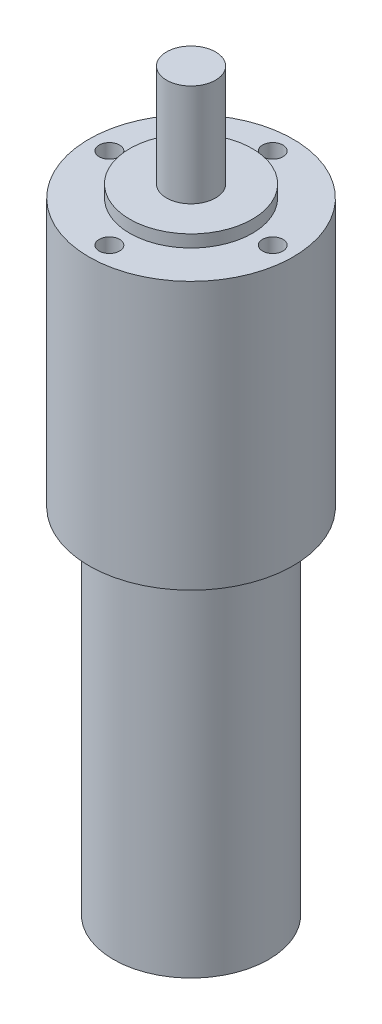
ISO-10303-21;
HEADER;
FILE_DESCRIPTION(('STEP AP214'),'2;1');
FILE_NAME('part.step','',(''),(''),'','','');
FILE_SCHEMA(('AUTOMOTIVE_DESIGN { 1 0 10303 214 1 1 1 1 }'));
ENDSEC;
DATA;
#1=APPLICATION_CONTEXT('core data for automotive mechanical design processes');
#2=APPLICATION_PROTOCOL_DEFINITION('international standard','automotive_design',2000,#1);
#3=PRODUCT_CONTEXT('',#1,'mechanical');
#4=PRODUCT('Part','Part','',(#3));
#5=PRODUCT_RELATED_PRODUCT_CATEGORY('part','',(#4));
#6=PRODUCT_DEFINITION_FORMATION('','',#4);
#7=PRODUCT_DEFINITION_CONTEXT('part definition',#1,'design');
#8=PRODUCT_DEFINITION('design','',#6,#7);
#9=PRODUCT_DEFINITION_SHAPE('','',#8);
#10=(LENGTH_UNIT() NAMED_UNIT(*) SI_UNIT(.MILLI.,.METRE.));
#11=(NAMED_UNIT(*) PLANE_ANGLE_UNIT() SI_UNIT($,.RADIAN.));
#12=(NAMED_UNIT(*) SI_UNIT($,.STERADIAN.) SOLID_ANGLE_UNIT());
#13=UNCERTAINTY_MEASURE_WITH_UNIT(LENGTH_MEASURE(1.E-05),#10,'distance_accuracy_value','');
#14=(GEOMETRIC_REPRESENTATION_CONTEXT(3) GLOBAL_UNCERTAINTY_ASSIGNED_CONTEXT((#13)) GLOBAL_UNIT_ASSIGNED_CONTEXT((#10,
#11,#12)) REPRESENTATION_CONTEXT('',''));
#15=CARTESIAN_POINT('',(0.,0.,0.));
#16=DIRECTION('',(0.,0.,1.));
#17=DIRECTION('',(1.,0.,0.));
#18=AXIS2_PLACEMENT_3D('',#15,#16,#17);
#19=CARTESIAN_POINT('',(0.,65.5,0.));
#20=DIRECTION('',(0.,-1.,0.));
#21=DIRECTION('',(0.,0.,-1.));
#22=AXIS2_PLACEMENT_3D('',#19,#20,#21);
#23=CYLINDRICAL_SURFACE('',#22,25.);
#24=CARTESIAN_POINT('',(0.,65.5,0.));
#25=DIRECTION('',(0.,1.,0.));
#26=DIRECTION('',(0.,0.,1.));
#27=AXIS2_PLACEMENT_3D('',#24,#25,#26);
#28=CIRCLE('',#27,25.);
#29=CARTESIAN_POINT('',(0.,65.5,25.));
#30=VERTEX_POINT('',#29);
#31=EDGE_CURVE('E52',#30,#30,#28,.T.);
#32=ORIENTED_EDGE('',*,*,#31,.F.);
#33=EDGE_LOOP('',(#32));
#34=FACE_BOUND('',#33,.T.);
#35=CARTESIAN_POINT('',(0.,0.,0.));
#36=DIRECTION('',(0.,1.,0.));
#37=DIRECTION('',(0.,0.,1.));
#38=AXIS2_PLACEMENT_3D('',#35,#36,#37);
#39=CIRCLE('',#38,25.);
#40=CARTESIAN_POINT('',(0.,0.,25.));
#41=VERTEX_POINT('',#40);
#42=EDGE_CURVE('E56',#41,#41,#39,.T.);
#43=ORIENTED_EDGE('',*,*,#42,.T.);
#44=EDGE_LOOP('',(#43));
#45=FACE_BOUND('',#44,.T.);
#46=ADVANCED_FACE('F46',(#34,#45),#23,.T.);
#47=CARTESIAN_POINT('',(0.,65.5,0.));
#48=DIRECTION('',(0.,1.,0.));
#49=DIRECTION('',(0.,0.,1.));
#50=AXIS2_PLACEMENT_3D('',#47,#48,#49);
#51=PLANE('',#50);
#52=CARTESIAN_POINT('',(20.0000000000006,65.5,-5.65984895009786E-13));
#53=DIRECTION('',(0.,1.,0.));
#54=DIRECTION('',(0.,0.,1.));
#55=AXIS2_PLACEMENT_3D('',#52,#53,#54);
#56=CIRCLE('',#55,2.50000000000044);
#57=CARTESIAN_POINT('',(20.0000000000006,65.5,2.49999999999988));
#58=VERTEX_POINT('',#57);
#59=EDGE_CURVE('E96',#58,#58,#56,.T.);
#60=ORIENTED_EDGE('',*,*,#59,.F.);
#61=EDGE_LOOP('',(#60));
#62=FACE_BOUND('',#61,.T.);
#63=CARTESIAN_POINT('',(1.13196979001957E-12,65.5,20.));
#64=DIRECTION('',(0.,1.,0.));
#65=DIRECTION('',(0.,0.,1.));
#66=AXIS2_PLACEMENT_3D('',#63,#64,#65);
#67=CIRCLE('',#66,2.50000000000122);
#68=CARTESIAN_POINT('',(1.13196979001957E-12,65.5,22.5000000000012));
#69=VERTEX_POINT('',#68);
#70=EDGE_CURVE('E90',#69,#69,#67,.T.);
#71=ORIENTED_EDGE('',*,*,#70,.F.);
#72=EDGE_LOOP('',(#71));
#73=FACE_BOUND('',#72,.T.);
#74=CARTESIAN_POINT('',(-19.9999999999994,65.5,5.6843418860808E-13));
#75=DIRECTION('',(0.,1.,0.));
#76=DIRECTION('',(0.,0.,1.));
#77=AXIS2_PLACEMENT_3D('',#74,#75,#76);
#78=CIRCLE('',#77,2.50000000000091);
#79=CARTESIAN_POINT('',(-19.9999999999994,65.5,2.50000000000148));
#80=VERTEX_POINT('',#79);
#81=EDGE_CURVE('E84',#80,#80,#78,.T.);
#82=ORIENTED_EDGE('',*,*,#81,.F.);
#83=EDGE_LOOP('',(#82));
#84=FACE_BOUND('',#83,.T.);
#85=CARTESIAN_POINT('',(0.,65.5,-20.));
#86=DIRECTION('',(0.,1.,0.));
#87=DIRECTION('',(0.,0.,1.));
#88=AXIS2_PLACEMENT_3D('',#85,#86,#87);
#89=CIRCLE('',#88,2.5);
#90=CARTESIAN_POINT('',(0.,65.5,-17.5));
#91=VERTEX_POINT('',#90);
#92=EDGE_CURVE('E78',#91,#91,#89,.T.);
#93=ORIENTED_EDGE('',*,*,#92,.F.);
#94=EDGE_LOOP('',(#93));
#95=FACE_BOUND('',#94,.T.);
#96=CARTESIAN_POINT('',(0.,65.5,0.));
#97=DIRECTION('',(0.,1.,0.));
#98=DIRECTION('',(0.,0.,1.));
#99=AXIS2_PLACEMENT_3D('',#96,#97,#98);
#100=CIRCLE('',#99,15.);
#101=CARTESIAN_POINT('',(0.,65.5,15.));
#102=VERTEX_POINT('',#101);
#103=EDGE_CURVE('E63',#102,#102,#100,.T.);
#104=ORIENTED_EDGE('',*,*,#103,.F.);
#105=EDGE_LOOP('',(#104));
#106=FACE_BOUND('',#105,.T.);
#107=ORIENTED_EDGE('',*,*,#31,.T.);
#108=EDGE_LOOP('',(#107));
#109=FACE_BOUND('',#108,.T.);
#110=ADVANCED_FACE('F111',(#62,#73,#84,#95,#106,#109),#51,.T.);
#111=CARTESIAN_POINT('',(0.,0.,0.));
#112=DIRECTION('',(0.,1.,0.));
#113=DIRECTION('',(0.,0.,1.));
#114=AXIS2_PLACEMENT_3D('',#111,#112,#113);
#115=PLANE('',#114);
#116=CARTESIAN_POINT('',(0.,0.,0.));
#117=DIRECTION('',(0.,1.,0.));
#118=DIRECTION('',(0.,0.,1.));
#119=AXIS2_PLACEMENT_3D('',#116,#117,#118);
#120=CIRCLE('',#119,19.);
#121=CARTESIAN_POINT('',(0.,0.,19.));
#122=VERTEX_POINT('',#121);
#123=EDGE_CURVE('E12',#122,#122,#120,.F.);
#124=ORIENTED_EDGE('',*,*,#123,.F.);
#125=EDGE_LOOP('',(#124));
#126=FACE_BOUND('',#125,.T.);
#127=ORIENTED_EDGE('',*,*,#42,.F.);
#128=EDGE_LOOP('',(#127));
#129=FACE_BOUND('',#128,.T.);
#130=ADVANCED_FACE('F114',(#126,#129),#115,.F.);
#131=CARTESIAN_POINT('',(0.,68.5,0.));
#132=DIRECTION('',(0.,-1.,0.));
#133=DIRECTION('',(0.,0.,-1.));
#134=AXIS2_PLACEMENT_3D('',#131,#132,#133);
#135=CYLINDRICAL_SURFACE('',#134,15.);
#136=CARTESIAN_POINT('',(0.,68.5,0.));
#137=DIRECTION('',(0.,1.,0.));
#138=DIRECTION('',(0.,0.,1.));
#139=AXIS2_PLACEMENT_3D('',#136,#137,#138);
#140=CIRCLE('',#139,15.);
#141=CARTESIAN_POINT('',(0.,68.5,15.));
#142=VERTEX_POINT('',#141);
#143=EDGE_CURVE('E61',#142,#142,#140,.T.);
#144=ORIENTED_EDGE('',*,*,#143,.F.);
#145=EDGE_LOOP('',(#144));
#146=FACE_BOUND('',#145,.T.);
#147=ORIENTED_EDGE('',*,*,#103,.T.);
#148=EDGE_LOOP('',(#147));
#149=FACE_BOUND('',#148,.T.);
#150=ADVANCED_FACE('F124',(#146,#149),#135,.T.);
#151=CARTESIAN_POINT('',(0.,68.5,0.));
#152=DIRECTION('',(0.,1.,0.));
#153=DIRECTION('',(0.,0.,1.));
#154=AXIS2_PLACEMENT_3D('',#151,#152,#153);
#155=PLANE('',#154);
#156=CARTESIAN_POINT('',(0.,68.5,0.));
#157=DIRECTION('',(0.,1.,0.));
#158=DIRECTION('',(0.,0.,1.));
#159=AXIS2_PLACEMENT_3D('',#156,#157,#158);
#160=CIRCLE('',#159,6.);
#161=CARTESIAN_POINT('',(0.,68.5,6.));
#162=VERTEX_POINT('',#161);
#163=EDGE_CURVE('E69',#162,#162,#160,.T.);
#164=ORIENTED_EDGE('',*,*,#163,.F.);
#165=EDGE_LOOP('',(#164));
#166=FACE_BOUND('',#165,.T.);
#167=ORIENTED_EDGE('',*,*,#143,.T.);
#168=EDGE_LOOP('',(#167));
#169=FACE_BOUND('',#168,.T.);
#170=ADVANCED_FACE('F126',(#166,#169),#155,.T.);
#171=CARTESIAN_POINT('',(0.,93.5,0.));
#172=DIRECTION('',(0.,-1.,0.));
#173=DIRECTION('',(0.,0.,-1.));
#174=AXIS2_PLACEMENT_3D('',#171,#172,#173);
#175=CYLINDRICAL_SURFACE('',#174,6.);
#176=CARTESIAN_POINT('',(0.,93.5,0.));
#177=DIRECTION('',(0.,1.,0.));
#178=DIRECTION('',(0.,0.,1.));
#179=AXIS2_PLACEMENT_3D('',#176,#177,#178);
#180=CIRCLE('',#179,6.);
#181=CARTESIAN_POINT('',(0.,93.5,6.));
#182=VERTEX_POINT('',#181);
#183=EDGE_CURVE('E66',#182,#182,#180,.T.);
#184=ORIENTED_EDGE('',*,*,#183,.F.);
#185=EDGE_LOOP('',(#184));
#186=FACE_BOUND('',#185,.T.);
#187=ORIENTED_EDGE('',*,*,#163,.T.);
#188=EDGE_LOOP('',(#187));
#189=FACE_BOUND('',#188,.T.);
#190=ADVANCED_FACE('F133',(#186,#189),#175,.T.);
#191=CARTESIAN_POINT('',(0.,93.5,0.));
#192=DIRECTION('',(0.,1.,0.));
#193=DIRECTION('',(0.,0.,1.));
#194=AXIS2_PLACEMENT_3D('',#191,#192,#193);
#195=PLANE('',#194);
#196=ORIENTED_EDGE('',*,*,#183,.T.);
#197=EDGE_LOOP('',(#196));
#198=FACE_BOUND('',#197,.T.);
#199=ADVANCED_FACE('F162',(#198),#195,.T.);
#200=CARTESIAN_POINT('',(0.,-86.5,0.));
#201=DIRECTION('',(0.,1.,0.));
#202=DIRECTION('',(0.,0.,1.));
#203=AXIS2_PLACEMENT_3D('',#200,#201,#202);
#204=CYLINDRICAL_SURFACE('',#203,19.);
#205=CARTESIAN_POINT('',(0.,-86.5,0.));
#206=DIRECTION('',(0.,-1.,0.));
#207=DIRECTION('',(0.,0.,-1.));
#208=AXIS2_PLACEMENT_3D('',#205,#206,#207);
#209=CIRCLE('',#208,19.);
#210=CARTESIAN_POINT('',(0.,-86.5,-19.));
#211=VERTEX_POINT('',#210);
#212=EDGE_CURVE('E72',#211,#211,#209,.T.);
#213=ORIENTED_EDGE('',*,*,#212,.F.);
#214=EDGE_LOOP('',(#213));
#215=FACE_BOUND('',#214,.T.);
#216=ORIENTED_EDGE('',*,*,#123,.T.);
#217=EDGE_LOOP('',(#216));
#218=FACE_BOUND('',#217,.T.);
#219=ADVANCED_FACE('F167',(#215,#218),#204,.T.);
#220=CARTESIAN_POINT('',(0.,-86.5,0.));
#221=DIRECTION('',(0.,-1.,0.));
#222=DIRECTION('',(0.,0.,-1.));
#223=AXIS2_PLACEMENT_3D('',#220,#221,#222);
#224=PLANE('',#223);
#225=ORIENTED_EDGE('',*,*,#212,.T.);
#226=EDGE_LOOP('',(#225));
#227=FACE_BOUND('',#226,.T.);
#228=ADVANCED_FACE('F171',(#227),#224,.T.);
#229=CARTESIAN_POINT('',(0.,55.5,-20.));
#230=DIRECTION('',(0.,1.,0.));
#231=DIRECTION('',(0.,0.,1.));
#232=AXIS2_PLACEMENT_3D('',#229,#230,#231);
#233=CYLINDRICAL_SURFACE('',#232,2.5);
#234=CARTESIAN_POINT('',(0.,55.5,-20.));
#235=DIRECTION('',(0.,1.,0.));
#236=DIRECTION('',(0.,0.,1.));
#237=AXIS2_PLACEMENT_3D('',#234,#235,#236);
#238=CIRCLE('',#237,2.5);
#239=CARTESIAN_POINT('',(0.,55.5,-17.5));
#240=VERTEX_POINT('',#239);
#241=EDGE_CURVE('E77',#240,#240,#238,.T.);
#242=ORIENTED_EDGE('',*,*,#241,.F.);
#243=EDGE_LOOP('',(#242));
#244=FACE_BOUND('',#243,.T.);
#245=ORIENTED_EDGE('',*,*,#92,.T.);
#246=EDGE_LOOP('',(#245));
#247=FACE_BOUND('',#246,.T.);
#248=ADVANCED_FACE('F180',(#244,#247),#233,.F.);
#249=CARTESIAN_POINT('',(0.,55.5,-20.));
#250=DIRECTION('',(0.,1.,0.));
#251=DIRECTION('',(0.,0.,1.));
#252=AXIS2_PLACEMENT_3D('',#249,#250,#251);
#253=PLANE('',#252);
#254=ORIENTED_EDGE('',*,*,#241,.T.);
#255=EDGE_LOOP('',(#254));
#256=FACE_BOUND('',#255,.T.);
#257=ADVANCED_FACE('F190',(#256),#253,.T.);
#258=CARTESIAN_POINT('',(-19.9999999999994,55.5,5.6843418860808E-13));
#259=DIRECTION('',(0.,1.,0.));
#260=DIRECTION('',(0.,0.,1.));
#261=AXIS2_PLACEMENT_3D('',#258,#259,#260);
#262=CYLINDRICAL_SURFACE('',#261,2.50000000000091);
#263=CARTESIAN_POINT('',(-19.9999999999994,55.5,5.6843418860808E-13));
#264=DIRECTION('',(0.,1.,0.));
#265=DIRECTION('',(0.,0.,1.));
#266=AXIS2_PLACEMENT_3D('',#263,#264,#265);
#267=CIRCLE('',#266,2.50000000000091);
#268=CARTESIAN_POINT('',(-19.9999999999994,55.5,2.50000000000148));
#269=VERTEX_POINT('',#268);
#270=EDGE_CURVE('E87',#269,#269,#267,.T.);
#271=ORIENTED_EDGE('',*,*,#270,.F.);
#272=EDGE_LOOP('',(#271));
#273=FACE_BOUND('',#272,.T.);
#274=ORIENTED_EDGE('',*,*,#81,.T.);
#275=EDGE_LOOP('',(#274));
#276=FACE_BOUND('',#275,.T.);
#277=ADVANCED_FACE('F197',(#273,#276),#262,.F.);
#278=CARTESIAN_POINT('',(-19.9999999999994,55.5,5.6843418860808E-13));
#279=DIRECTION('',(0.,1.,0.));
#280=DIRECTION('',(0.,0.,1.));
#281=AXIS2_PLACEMENT_3D('',#278,#279,#280);
#282=PLANE('',#281);
#283=ORIENTED_EDGE('',*,*,#270,.T.);
#284=EDGE_LOOP('',(#283));
#285=FACE_BOUND('',#284,.T.);
#286=ADVANCED_FACE('F205',(#285),#282,.T.);
#287=CARTESIAN_POINT('',(1.13196979001957E-12,55.5,20.));
#288=DIRECTION('',(0.,1.,0.));
#289=DIRECTION('',(0.,0.,1.));
#290=AXIS2_PLACEMENT_3D('',#287,#288,#289);
#291=CYLINDRICAL_SURFACE('',#290,2.50000000000122);
#292=CARTESIAN_POINT('',(1.13196979001957E-12,55.5,20.));
#293=DIRECTION('',(0.,1.,0.));
#294=DIRECTION('',(0.,0.,1.));
#295=AXIS2_PLACEMENT_3D('',#292,#293,#294);
#296=CIRCLE('',#295,2.50000000000122);
#297=CARTESIAN_POINT('',(1.13196979001957E-12,55.5,22.5000000000012));
#298=VERTEX_POINT('',#297);
#299=EDGE_CURVE('E93',#298,#298,#296,.T.);
#300=ORIENTED_EDGE('',*,*,#299,.F.);
#301=EDGE_LOOP('',(#300));
#302=FACE_BOUND('',#301,.T.);
#303=ORIENTED_EDGE('',*,*,#70,.T.);
#304=EDGE_LOOP('',(#303));
#305=FACE_BOUND('',#304,.T.);
#306=ADVANCED_FACE('F213',(#302,#305),#291,.F.);
#307=CARTESIAN_POINT('',(1.13196979001957E-12,55.5,20.));
#308=DIRECTION('',(0.,1.,0.));
#309=DIRECTION('',(0.,0.,1.));
#310=AXIS2_PLACEMENT_3D('',#307,#308,#309);
#311=PLANE('',#310);
#312=ORIENTED_EDGE('',*,*,#299,.T.);
#313=EDGE_LOOP('',(#312));
#314=FACE_BOUND('',#313,.T.);
#315=ADVANCED_FACE('F107',(#314),#311,.T.);
#316=CARTESIAN_POINT('',(20.0000000000006,55.5,-5.65984895009786E-13));
#317=DIRECTION('',(0.,1.,0.));
#318=DIRECTION('',(0.,0.,1.));
#319=AXIS2_PLACEMENT_3D('',#316,#317,#318);
#320=CYLINDRICAL_SURFACE('',#319,2.50000000000044);
#321=CARTESIAN_POINT('',(20.0000000000006,55.5,-5.65984895009786E-13));
#322=DIRECTION('',(0.,1.,0.));
#323=DIRECTION('',(0.,0.,1.));
#324=AXIS2_PLACEMENT_3D('',#321,#322,#323);
#325=CIRCLE('',#324,2.50000000000044);
#326=CARTESIAN_POINT('',(20.0000000000006,55.5,2.49999999999988));
#327=VERTEX_POINT('',#326);
#328=EDGE_CURVE('E81',#327,#327,#325,.T.);
#329=ORIENTED_EDGE('',*,*,#328,.F.);
#330=EDGE_LOOP('',(#329));
#331=FACE_BOUND('',#330,.T.);
#332=ORIENTED_EDGE('',*,*,#59,.T.);
#333=EDGE_LOOP('',(#332));
#334=FACE_BOUND('',#333,.T.);
#335=ADVANCED_FACE('F104',(#331,#334),#320,.F.);
#336=CARTESIAN_POINT('',(20.0000000000006,55.5,-5.65984895009786E-13));
#337=DIRECTION('',(0.,1.,0.));
#338=DIRECTION('',(0.,0.,1.));
#339=AXIS2_PLACEMENT_3D('',#336,#337,#338);
#340=PLANE('',#339);
#341=ORIENTED_EDGE('',*,*,#328,.T.);
#342=EDGE_LOOP('',(#341));
#343=FACE_BOUND('',#342,.T.);
#344=ADVANCED_FACE('F102',(#343),#340,.T.);
#345=CLOSED_SHELL('',(#46,#110,#130,#150,#170,#190,#199,#219,#228,#248,#257,#277,#286,#306,#315,
#335,#344));
#346=MANIFOLD_SOLID_BREP('B2',#345);
#347=ADVANCED_BREP_SHAPE_REPRESENTATION('',(#18,#346),#14);
#348=SHAPE_DEFINITION_REPRESENTATION(#9,#347);
ENDSEC;
END-ISO-10303-21;
